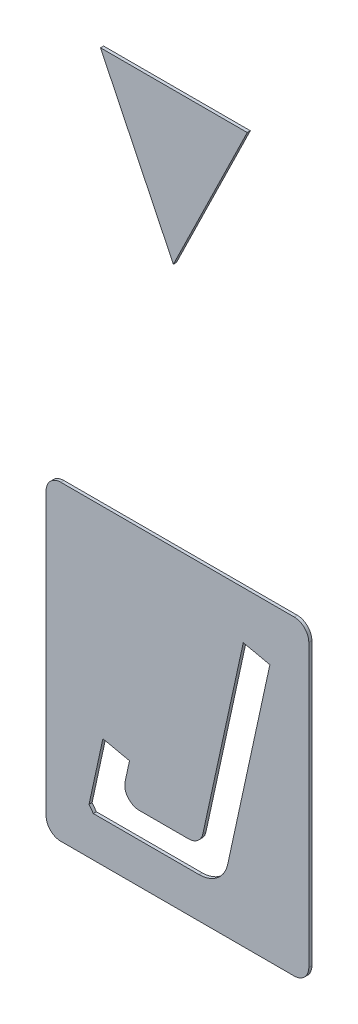
ISO-10303-21;
HEADER;
FILE_DESCRIPTION(('STEP AP214'),'2;1');
FILE_NAME('part.step','',(''),(''),'','','');
FILE_SCHEMA(('AUTOMOTIVE_DESIGN { 1 0 10303 214 1 1 1 1 }'));
ENDSEC;
DATA;
#1=APPLICATION_CONTEXT('core data for automotive mechanical design processes');
#2=APPLICATION_PROTOCOL_DEFINITION('international standard','automotive_design',2000,#1);
#3=PRODUCT_CONTEXT('',#1,'mechanical');
#4=PRODUCT('Part','Part','',(#3));
#5=PRODUCT_RELATED_PRODUCT_CATEGORY('part','',(#4));
#6=PRODUCT_DEFINITION_FORMATION('','',#4);
#7=PRODUCT_DEFINITION_CONTEXT('part definition',#1,'design');
#8=PRODUCT_DEFINITION('design','',#6,#7);
#9=PRODUCT_DEFINITION_SHAPE('','',#8);
#10=(LENGTH_UNIT() NAMED_UNIT(*) SI_UNIT(.MILLI.,.METRE.));
#11=(NAMED_UNIT(*) PLANE_ANGLE_UNIT() SI_UNIT($,.RADIAN.));
#12=(NAMED_UNIT(*) SI_UNIT($,.STERADIAN.) SOLID_ANGLE_UNIT());
#13=UNCERTAINTY_MEASURE_WITH_UNIT(LENGTH_MEASURE(1.E-05),#10,'distance_accuracy_value','');
#14=(GEOMETRIC_REPRESENTATION_CONTEXT(3) GLOBAL_UNCERTAINTY_ASSIGNED_CONTEXT((#13)) GLOBAL_UNIT_ASSIGNED_CONTEXT((#10,
#11,#12)) REPRESENTATION_CONTEXT('',''));
#15=CARTESIAN_POINT('',(0.,0.,0.));
#16=DIRECTION('',(0.,0.,1.));
#17=DIRECTION('',(1.,0.,0.));
#18=AXIS2_PLACEMENT_3D('',#15,#16,#17);
#19=CARTESIAN_POINT('',(3.013889286367,-4.558794197389,0.01));
#20=DIRECTION('',(0.,0.,1.));
#21=DIRECTION('',(1.,0.,0.));
#22=AXIS2_PLACEMENT_3D('',#19,#20,#21);
#23=PLANE('',#22);
#24=DIRECTION('',(0.977176362822359,-0.212429649393078,0.));
#25=VECTOR('',#24,1.);
#26=CARTESIAN_POINT('',(2.915138823425,-4.73816514826,0.01));
#27=LINE('',#26,#25);
#28=CARTESIAN_POINT('',(2.771556768626,-4.706951657308,0.01));
#29=VERTEX_POINT('',#28);
#30=CARTESIAN_POINT('',(2.858078652016,-4.725760762862,0.01));
#31=VERTEX_POINT('',#30);
#32=EDGE_CURVE('P0_E363',#29,#31,#27,.T.);
#33=ORIENTED_EDGE('',*,*,#32,.T.);
#34=DIRECTION('',(-0.212429649393078,-0.977176362822359,0.));
#35=VECTOR('',#34,1.);
#36=CARTESIAN_POINT('',(2.871735257351,-4.662940379891,0.01));
#37=LINE('',#36,#35);
#38=CARTESIAN_POINT('',(2.843701571152,-4.791895333189,0.01));
#39=VERTEX_POINT('',#38);
#40=EDGE_CURVE('P0_E144',#31,#39,#37,.T.);
#41=ORIENTED_EDGE('',*,*,#40,.T.);
#42=CARTESIAN_POINT('',(2.890239595431,-4.802012295242,0.01));
#43=DIRECTION('',(0.,0.,1.));
#44=DIRECTION('',(-0.977176362822359,0.212429649393078,0.));
#45=AXIS2_PLACEMENT_3D('',#42,#43,#44);
#46=CIRCLE('',#45,0.047625);
#47=CARTESIAN_POINT('',(2.890239595431,-4.849637295242,0.01));
#48=VERTEX_POINT('',#47);
#49=EDGE_CURVE('P0_E320',#39,#48,#46,.T.);
#50=ORIENTED_EDGE('',*,*,#49,.T.);
#51=DIRECTION('',(1.,0.,0.));
#52=VECTOR('',#51,1.);
#53=CARTESIAN_POINT('',(3.031905497518,-4.849637295242,0.01));
#54=LINE('',#53,#52);
#55=CARTESIAN_POINT('',(3.049921708669,-4.849637295242,0.01));
#56=VERTEX_POINT('',#55);
#57=EDGE_CURVE('P0_E21',#48,#56,#54,.T.);
#58=ORIENTED_EDGE('',*,*,#57,.T.);
#59=CARTESIAN_POINT('',(3.049921708669,-4.802012295242,0.01));
#60=DIRECTION('',(0.,0.,1.));
#61=DIRECTION('',(0.,-1.,0.));
#62=AXIS2_PLACEMENT_3D('',#59,#60,#61);
#63=CIRCLE('',#62,0.047625);
#64=CARTESIAN_POINT('',(3.096459732948,-4.812129257294,0.01));
#65=VERTEX_POINT('',#64);
#66=EDGE_CURVE('P0_E244',#56,#65,#63,.T.);
#67=ORIENTED_EDGE('',*,*,#66,.T.);
#68=DIRECTION('',(0.212429649393078,0.977176362822359,0.));
#69=VECTOR('',#68,1.);
#70=CARTESIAN_POINT('',(3.186501533019,-4.397936987306,0.01));
#71=LINE('',#70,#69);
#72=CARTESIAN_POINT('',(3.22768183257,-4.208507614097,0.01));
#73=VERTEX_POINT('',#72);
#74=EDGE_CURVE('P0_E230',#65,#73,#71,.T.);
#75=ORIENTED_EDGE('',*,*,#74,.T.);
#76=DIRECTION('',(0.977176362822359,-0.212429649393078,0.));
#77=VECTOR('',#76,1.);
#78=CARTESIAN_POINT('',(3.205226800715,-4.203626085311,0.01));
#79=LINE('',#78,#77);
#80=CARTESIAN_POINT('',(3.314203715961,-4.227316719651,0.01));
#81=VERTEX_POINT('',#80);
#82=EDGE_CURVE('P0_E215',#73,#81,#79,.T.);
#83=ORIENTED_EDGE('',*,*,#82,.T.);
#84=DIRECTION('',(-0.212429649393078,-0.977176362822359,0.));
#85=VECTOR('',#84,1.);
#86=CARTESIAN_POINT('',(3.204463883375,-4.73211993695,0.01));
#87=LINE('',#86,#85);
#88=CARTESIAN_POINT('',(3.177084649891,-4.858064407831,0.01));
#89=VERTEX_POINT('',#88);
#90=EDGE_CURVE('P0_E220',#81,#89,#87,.T.);
#91=ORIENTED_EDGE('',*,*,#90,.T.);
#92=CARTESIAN_POINT('',(3.084008601332,-4.837830483727,0.01));
#93=DIRECTION('',(0.,0.,-1.));
#94=DIRECTION('',(0.,1.,0.));
#95=AXIS2_PLACEMENT_3D('',#92,#93,#94);
#96=CIRCLE('',#95,0.09525);
#97=CARTESIAN_POINT('',(3.084008601332,-4.933080483727,0.01));
#98=VERTEX_POINT('',#97);
#99=EDGE_CURVE('P0_E334',#89,#98,#96,.T.);
#100=ORIENTED_EDGE('',*,*,#99,.T.);
#101=DIRECTION('',(-1.,0.,0.));
#102=VECTOR('',#101,1.);
#103=CARTESIAN_POINT('',(2.877213718638,-4.933080483727,0.01));
#104=LINE('',#103,#102);
#105=CARTESIAN_POINT('',(2.74053815091,-4.933080483727,0.01));
#106=VERTEX_POINT('',#105);
#107=EDGE_CURVE('P0_E250',#98,#106,#104,.T.);
#108=ORIENTED_EDGE('',*,*,#107,.T.);
#109=DIRECTION('',(-0.598473967642059,0.801142253320078,0.));
#110=VECTOR('',#109,1.);
#111=CARTESIAN_POINT('',(2.692737771758,-4.869092899415,0.01));
#112=LINE('',#111,#110);
#113=CARTESIAN_POINT('',(2.726487262965,-4.914271378172,0.01));
#114=VERTEX_POINT('',#113);
#115=EDGE_CURVE('P0_E357',#106,#114,#112,.T.);
#116=ORIENTED_EDGE('',*,*,#115,.T.);
#117=DIRECTION('',(0.212429649393078,0.977176362822359,0.));
#118=VECTOR('',#117,1.);
#119=CARTESIAN_POINT('',(2.792401914393,-4.611063989173,0.01));
#120=LINE('',#119,#118);
#121=EDGE_CURVE('P0_E129',#114,#29,#120,.T.);
#122=ORIENTED_EDGE('',*,*,#121,.T.);
#123=EDGE_LOOP('',(#33,#41,#50,#58,#67,#75,#83,#91,#100,#108,#116,#122));
#124=FACE_BOUND('',#123,.T.);
#125=CARTESIAN_POINT('',(2.634724387193,-4.101239326386,0.01));
#126=DIRECTION('',(0.,0.,1.));
#127=DIRECTION('',(0.,-1.,0.));
#128=AXIS2_PLACEMENT_3D('',#125,#126,#127);
#129=CIRCLE('',#128,0.047625);
#130=CARTESIAN_POINT('',(2.634724387193,-4.053614326386,0.01));
#131=VERTEX_POINT('',#130);
#132=CARTESIAN_POINT('',(2.587099387193,-4.101239326386,0.01));
#133=VERTEX_POINT('',#132);
#134=EDGE_CURVE('P0_E11',#131,#133,#129,.T.);
#135=ORIENTED_EDGE('',*,*,#134,.T.);
#136=DIRECTION('',(0.,-1.,0.));
#137=VECTOR('',#136,1.);
#138=CARTESIAN_POINT('',(2.587099387193,-5.016349068392,0.01));
#139=LINE('',#138,#137);
#140=CARTESIAN_POINT('',(2.587099387193,-5.016349068392,0.01));
#141=VERTEX_POINT('',#140);
#142=EDGE_CURVE('P0_E343',#133,#141,#139,.T.);
#143=ORIENTED_EDGE('',*,*,#142,.T.);
#144=CARTESIAN_POINT('',(2.634724387193,-5.016349068392,0.01));
#145=DIRECTION('',(0.,0.,1.));
#146=DIRECTION('',(1.,0.,0.));
#147=AXIS2_PLACEMENT_3D('',#144,#145,#146);
#148=CIRCLE('',#147,0.047625);
#149=CARTESIAN_POINT('',(2.634724387193,-5.063974068392,0.01));
#150=VERTEX_POINT('',#149);
#151=EDGE_CURVE('P0_E265',#141,#150,#148,.T.);
#152=ORIENTED_EDGE('',*,*,#151,.T.);
#153=DIRECTION('',(1.,0.,0.));
#154=VECTOR('',#153,1.);
#155=CARTESIAN_POINT('',(3.393054185541,-5.063974068392,0.01));
#156=LINE('',#155,#154);
#157=CARTESIAN_POINT('',(3.393054185541,-5.063974068392,0.01));
#158=VERTEX_POINT('',#157);
#159=EDGE_CURVE('P0_E266',#150,#158,#156,.T.);
#160=ORIENTED_EDGE('',*,*,#159,.T.);
#161=CARTESIAN_POINT('',(3.393054185541,-5.016349068392,0.01));
#162=DIRECTION('',(0.,0.,1.));
#163=DIRECTION('',(0.,1.,0.));
#164=AXIS2_PLACEMENT_3D('',#161,#162,#163);
#165=CIRCLE('',#164,0.047625);
#166=CARTESIAN_POINT('',(3.440679185541,-5.016349068392,0.01));
#167=VERTEX_POINT('',#166);
#168=EDGE_CURVE('P0_E322',#158,#167,#165,.T.);
#169=ORIENTED_EDGE('',*,*,#168,.T.);
#170=DIRECTION('',(0.,1.,0.));
#171=VECTOR('',#170,1.);
#172=CARTESIAN_POINT('',(3.440679185541,-4.101239326386,0.01));
#173=LINE('',#172,#171);
#174=CARTESIAN_POINT('',(3.440679185541,-4.101239326386,0.01));
#175=VERTEX_POINT('',#174);
#176=EDGE_CURVE('P0_E430',#167,#175,#173,.T.);
#177=ORIENTED_EDGE('',*,*,#176,.T.);
#178=CARTESIAN_POINT('',(3.393054185541,-4.101239326386,0.01));
#179=DIRECTION('',(0.,0.,1.));
#180=DIRECTION('',(-1.,0.,0.));
#181=AXIS2_PLACEMENT_3D('',#178,#179,#180);
#182=CIRCLE('',#181,0.047625);
#183=CARTESIAN_POINT('',(3.393054185541,-4.053614326386,0.01));
#184=VERTEX_POINT('',#183);
#185=EDGE_CURVE('P0_E255',#175,#184,#182,.T.);
#186=ORIENTED_EDGE('',*,*,#185,.T.);
#187=DIRECTION('',(-1.,0.,0.));
#188=VECTOR('',#187,1.);
#189=CARTESIAN_POINT('',(2.634724387193,-4.053614326386,0.01));
#190=LINE('',#189,#188);
#191=EDGE_CURVE('P0_E295',#184,#131,#190,.T.);
#192=ORIENTED_EDGE('',*,*,#191,.T.);
#193=EDGE_LOOP('',(#135,#143,#152,#160,#169,#177,#186,#192));
#194=FACE_BOUND('',#193,.T.);
#195=ADVANCED_FACE('P0_F17',(#124,#194),#23,.T.);
#196=CARTESIAN_POINT('',(3.013889286367,-4.558794197389,0.));
#197=DIRECTION('',(0.,0.,1.));
#198=DIRECTION('',(1.,0.,0.));
#199=AXIS2_PLACEMENT_3D('',#196,#197,#198);
#200=PLANE('',#199);
#201=DIRECTION('',(-0.977176362822359,0.212429649393078,0.));
#202=VECTOR('',#201,1.);
#203=CARTESIAN_POINT('',(2.915138823425,-4.73816514826,0.));
#204=LINE('',#203,#202);
#205=CARTESIAN_POINT('',(2.858078652016,-4.725760762862,0.));
#206=VERTEX_POINT('',#205);
#207=CARTESIAN_POINT('',(2.771556768626,-4.706951657308,0.));
#208=VERTEX_POINT('',#207);
#209=EDGE_CURVE('P0_E282',#206,#208,#204,.T.);
#210=ORIENTED_EDGE('',*,*,#209,.T.);
#211=DIRECTION('',(-0.212429649393078,-0.977176362822359,0.));
#212=VECTOR('',#211,1.);
#213=CARTESIAN_POINT('',(2.792401914393,-4.611063989173,0.));
#214=LINE('',#213,#212);
#215=CARTESIAN_POINT('',(2.726487262965,-4.914271378172,0.));
#216=VERTEX_POINT('',#215);
#217=EDGE_CURVE('P0_E304',#208,#216,#214,.T.);
#218=ORIENTED_EDGE('',*,*,#217,.T.);
#219=DIRECTION('',(0.598473967642059,-0.801142253320078,0.));
#220=VECTOR('',#219,1.);
#221=CARTESIAN_POINT('',(2.692737771758,-4.869092899415,0.));
#222=LINE('',#221,#220);
#223=CARTESIAN_POINT('',(2.74053815091,-4.933080483727,0.));
#224=VERTEX_POINT('',#223);
#225=EDGE_CURVE('P0_E246',#216,#224,#222,.T.);
#226=ORIENTED_EDGE('',*,*,#225,.T.);
#227=DIRECTION('',(1.,0.,0.));
#228=VECTOR('',#227,1.);
#229=CARTESIAN_POINT('',(2.877213718638,-4.933080483727,0.));
#230=LINE('',#229,#228);
#231=CARTESIAN_POINT('',(3.084008601332,-4.933080483727,0.));
#232=VERTEX_POINT('',#231);
#233=EDGE_CURVE('P0_E300',#224,#232,#230,.T.);
#234=ORIENTED_EDGE('',*,*,#233,.T.);
#235=CARTESIAN_POINT('',(3.084008601332,-4.837830483727,0.));
#236=DIRECTION('',(0.,0.,1.));
#237=DIRECTION('',(0.,1.,0.));
#238=AXIS2_PLACEMENT_3D('',#235,#236,#237);
#239=CIRCLE('',#238,0.09525);
#240=CARTESIAN_POINT('',(3.177084649891,-4.858064407831,0.));
#241=VERTEX_POINT('',#240);
#242=EDGE_CURVE('P0_E209',#232,#241,#239,.T.);
#243=ORIENTED_EDGE('',*,*,#242,.T.);
#244=DIRECTION('',(0.212429649393078,0.977176362822359,0.));
#245=VECTOR('',#244,1.);
#246=CARTESIAN_POINT('',(3.204463883375,-4.73211993695,0.));
#247=LINE('',#246,#245);
#248=CARTESIAN_POINT('',(3.314203715961,-4.227316719651,0.));
#249=VERTEX_POINT('',#248);
#250=EDGE_CURVE('P0_E200',#241,#249,#247,.T.);
#251=ORIENTED_EDGE('',*,*,#250,.T.);
#252=DIRECTION('',(-0.977176362822359,0.212429649393078,0.));
#253=VECTOR('',#252,1.);
#254=CARTESIAN_POINT('',(3.205226800715,-4.203626085311,0.));
#255=LINE('',#254,#253);
#256=CARTESIAN_POINT('',(3.22768183257,-4.208507614097,0.));
#257=VERTEX_POINT('',#256);
#258=EDGE_CURVE('P0_E206',#249,#257,#255,.T.);
#259=ORIENTED_EDGE('',*,*,#258,.T.);
#260=DIRECTION('',(-0.212429649393078,-0.977176362822359,0.));
#261=VECTOR('',#260,1.);
#262=CARTESIAN_POINT('',(3.186501533019,-4.397936987306,0.));
#263=LINE('',#262,#261);
#264=CARTESIAN_POINT('',(3.096459732948,-4.812129257294,0.));
#265=VERTEX_POINT('',#264);
#266=EDGE_CURVE('P0_E273',#257,#265,#263,.T.);
#267=ORIENTED_EDGE('',*,*,#266,.T.);
#268=CARTESIAN_POINT('',(3.049921708669,-4.802012295242,0.));
#269=DIRECTION('',(0.,0.,-1.));
#270=DIRECTION('',(0.,-1.,0.));
#271=AXIS2_PLACEMENT_3D('',#268,#269,#270);
#272=CIRCLE('',#271,0.047625);
#273=CARTESIAN_POINT('',(3.049921708669,-4.849637295242,0.));
#274=VERTEX_POINT('',#273);
#275=EDGE_CURVE('P0_E245',#265,#274,#272,.T.);
#276=ORIENTED_EDGE('',*,*,#275,.T.);
#277=DIRECTION('',(-1.,0.,0.));
#278=VECTOR('',#277,1.);
#279=CARTESIAN_POINT('',(3.031905497518,-4.849637295242,0.));
#280=LINE('',#279,#278);
#281=CARTESIAN_POINT('',(2.890239595431,-4.849637295242,0.));
#282=VERTEX_POINT('',#281);
#283=EDGE_CURVE('P0_E372',#274,#282,#280,.T.);
#284=ORIENTED_EDGE('',*,*,#283,.T.);
#285=CARTESIAN_POINT('',(2.890239595431,-4.802012295242,0.));
#286=DIRECTION('',(0.,0.,-1.));
#287=DIRECTION('',(-0.977176362822359,0.212429649393078,0.));
#288=AXIS2_PLACEMENT_3D('',#285,#286,#287);
#289=CIRCLE('',#288,0.047625);
#290=CARTESIAN_POINT('',(2.843701571152,-4.791895333189,0.));
#291=VERTEX_POINT('',#290);
#292=EDGE_CURVE('P0_E321',#282,#291,#289,.T.);
#293=ORIENTED_EDGE('',*,*,#292,.T.);
#294=DIRECTION('',(0.212429649393078,0.977176362822359,0.));
#295=VECTOR('',#294,1.);
#296=CARTESIAN_POINT('',(2.871735257351,-4.662940379891,0.));
#297=LINE('',#296,#295);
#298=EDGE_CURVE('P0_E286',#291,#206,#297,.T.);
#299=ORIENTED_EDGE('',*,*,#298,.T.);
#300=EDGE_LOOP('',(#210,#218,#226,#234,#243,#251,#259,#267,#276,#284,#293,#299));
#301=FACE_BOUND('',#300,.T.);
#302=CARTESIAN_POINT('',(2.634724387193,-4.101239326386,0.));
#303=DIRECTION('',(0.,0.,-1.));
#304=DIRECTION('',(0.,-1.,0.));
#305=AXIS2_PLACEMENT_3D('',#302,#303,#304);
#306=CIRCLE('',#305,0.047625);
#307=CARTESIAN_POINT('',(2.587099387193,-4.101239326386,0.));
#308=VERTEX_POINT('',#307);
#309=CARTESIAN_POINT('',(2.634724387193,-4.053614326386,0.));
#310=VERTEX_POINT('',#309);
#311=EDGE_CURVE('P0_E28',#308,#310,#306,.T.);
#312=ORIENTED_EDGE('',*,*,#311,.T.);
#313=DIRECTION('',(1.,0.,0.));
#314=VECTOR('',#313,1.);
#315=CARTESIAN_POINT('',(2.634724387193,-4.053614326386,0.));
#316=LINE('',#315,#314);
#317=CARTESIAN_POINT('',(3.393054185541,-4.053614326386,0.));
#318=VERTEX_POINT('',#317);
#319=EDGE_CURVE('P0_E303',#310,#318,#316,.T.);
#320=ORIENTED_EDGE('',*,*,#319,.T.);
#321=CARTESIAN_POINT('',(3.393054185541,-4.101239326386,0.));
#322=DIRECTION('',(0.,0.,-1.));
#323=DIRECTION('',(-1.,0.,0.));
#324=AXIS2_PLACEMENT_3D('',#321,#322,#323);
#325=CIRCLE('',#324,0.047625);
#326=CARTESIAN_POINT('',(3.440679185541,-4.101239326386,0.));
#327=VERTEX_POINT('',#326);
#328=EDGE_CURVE('P0_E251',#318,#327,#325,.T.);
#329=ORIENTED_EDGE('',*,*,#328,.T.);
#330=DIRECTION('',(0.,-1.,0.));
#331=VECTOR('',#330,1.);
#332=CARTESIAN_POINT('',(3.440679185541,-4.101239326386,0.));
#333=LINE('',#332,#331);
#334=CARTESIAN_POINT('',(3.440679185541,-5.016349068392,0.));
#335=VERTEX_POINT('',#334);
#336=EDGE_CURVE('P0_E315',#327,#335,#333,.T.);
#337=ORIENTED_EDGE('',*,*,#336,.T.);
#338=CARTESIAN_POINT('',(3.393054185541,-5.016349068392,0.));
#339=DIRECTION('',(0.,0.,-1.));
#340=DIRECTION('',(0.,1.,0.));
#341=AXIS2_PLACEMENT_3D('',#338,#339,#340);
#342=CIRCLE('',#341,0.047625);
#343=CARTESIAN_POINT('',(3.393054185541,-5.063974068392,0.));
#344=VERTEX_POINT('',#343);
#345=EDGE_CURVE('P0_E326',#335,#344,#342,.T.);
#346=ORIENTED_EDGE('',*,*,#345,.T.);
#347=DIRECTION('',(-1.,0.,0.));
#348=VECTOR('',#347,1.);
#349=CARTESIAN_POINT('',(3.393054185541,-5.063974068392,0.));
#350=LINE('',#349,#348);
#351=CARTESIAN_POINT('',(2.634724387193,-5.063974068392,0.));
#352=VERTEX_POINT('',#351);
#353=EDGE_CURVE('P0_E270',#344,#352,#350,.T.);
#354=ORIENTED_EDGE('',*,*,#353,.T.);
#355=CARTESIAN_POINT('',(2.634724387193,-5.016349068392,0.));
#356=DIRECTION('',(0.,0.,-1.));
#357=DIRECTION('',(1.,0.,0.));
#358=AXIS2_PLACEMENT_3D('',#355,#356,#357);
#359=CIRCLE('',#358,0.047625);
#360=CARTESIAN_POINT('',(2.587099387193,-5.016349068392,0.));
#361=VERTEX_POINT('',#360);
#362=EDGE_CURVE('P0_E278',#352,#361,#359,.T.);
#363=ORIENTED_EDGE('',*,*,#362,.T.);
#364=DIRECTION('',(0.,1.,0.));
#365=VECTOR('',#364,1.);
#366=CARTESIAN_POINT('',(2.587099387193,-5.016349068392,0.));
#367=LINE('',#366,#365);
#368=EDGE_CURVE('P0_E264',#361,#308,#367,.T.);
#369=ORIENTED_EDGE('',*,*,#368,.T.);
#370=EDGE_LOOP('',(#312,#320,#329,#337,#346,#354,#363,#369));
#371=FACE_BOUND('',#370,.T.);
#372=ADVANCED_FACE('P0_F203',(#301,#371),#200,.F.);
#373=CARTESIAN_POINT('',(2.634724387193,-4.101239326386,0.));
#374=DIRECTION('',(0.,0.,1.));
#375=DIRECTION('',(0.,-1.,0.));
#376=AXIS2_PLACEMENT_3D('',#373,#374,#375);
#377=CYLINDRICAL_SURFACE('',#376,0.047625);
#378=ORIENTED_EDGE('',*,*,#311,.F.);
#379=DIRECTION('',(0.,0.,1.));
#380=VECTOR('',#379,1.);
#381=CARTESIAN_POINT('',(2.587099387193,-4.101239326386,0.));
#382=LINE('',#381,#380);
#383=EDGE_CURVE('P0_E281',#308,#133,#382,.T.);
#384=ORIENTED_EDGE('',*,*,#383,.T.);
#385=ORIENTED_EDGE('',*,*,#134,.F.);
#386=DIRECTION('',(0.,0.,1.));
#387=VECTOR('',#386,1.);
#388=CARTESIAN_POINT('',(2.634724387193,-4.053614326386,0.));
#389=LINE('',#388,#387);
#390=EDGE_CURVE('P0_E305',#310,#131,#389,.T.);
#391=ORIENTED_EDGE('',*,*,#390,.F.);
#392=EDGE_LOOP('',(#378,#384,#385,#391));
#393=FACE_BOUND('',#392,.T.);
#394=ADVANCED_FACE('P0_F477',(#393),#377,.T.);
#395=CARTESIAN_POINT('',(2.587099387193,-4.101239326386,0.));
#396=DIRECTION('',(-1.,0.,0.));
#397=DIRECTION('',(0.,0.,1.));
#398=AXIS2_PLACEMENT_3D('',#395,#396,#397);
#399=PLANE('',#398);
#400=ORIENTED_EDGE('',*,*,#368,.F.);
#401=DIRECTION('',(0.,0.,1.));
#402=VECTOR('',#401,1.);
#403=CARTESIAN_POINT('',(2.587099387193,-5.016349068392,0.));
#404=LINE('',#403,#402);
#405=EDGE_CURVE('P0_E260',#361,#141,#404,.T.);
#406=ORIENTED_EDGE('',*,*,#405,.T.);
#407=ORIENTED_EDGE('',*,*,#142,.F.);
#408=ORIENTED_EDGE('',*,*,#383,.F.);
#409=EDGE_LOOP('',(#400,#406,#407,#408));
#410=FACE_BOUND('',#409,.T.);
#411=ADVANCED_FACE('P0_F498',(#410),#399,.T.);
#412=CARTESIAN_POINT('',(2.634724387193,-5.016349068392,0.));
#413=DIRECTION('',(0.,0.,1.));
#414=DIRECTION('',(1.,0.,0.));
#415=AXIS2_PLACEMENT_3D('',#412,#413,#414);
#416=CYLINDRICAL_SURFACE('',#415,0.047625);
#417=ORIENTED_EDGE('',*,*,#362,.F.);
#418=DIRECTION('',(0.,0.,1.));
#419=VECTOR('',#418,1.);
#420=CARTESIAN_POINT('',(2.634724387193,-5.063974068392,0.));
#421=LINE('',#420,#419);
#422=EDGE_CURVE('P0_E269',#352,#150,#421,.T.);
#423=ORIENTED_EDGE('',*,*,#422,.T.);
#424=ORIENTED_EDGE('',*,*,#151,.F.);
#425=ORIENTED_EDGE('',*,*,#405,.F.);
#426=EDGE_LOOP('',(#417,#423,#424,#425));
#427=FACE_BOUND('',#426,.T.);
#428=ADVANCED_FACE('P0_F494',(#427),#416,.T.);
#429=CARTESIAN_POINT('',(2.634724387193,-5.063974068392,0.));
#430=DIRECTION('',(0.,-1.,0.));
#431=DIRECTION('',(0.,0.,-1.));
#432=AXIS2_PLACEMENT_3D('',#429,#430,#431);
#433=PLANE('',#432);
#434=ORIENTED_EDGE('',*,*,#353,.F.);
#435=DIRECTION('',(0.,0.,1.));
#436=VECTOR('',#435,1.);
#437=CARTESIAN_POINT('',(3.393054185541,-5.063974068392,0.));
#438=LINE('',#437,#436);
#439=EDGE_CURVE('P0_E325',#344,#158,#438,.T.);
#440=ORIENTED_EDGE('',*,*,#439,.T.);
#441=ORIENTED_EDGE('',*,*,#159,.F.);
#442=ORIENTED_EDGE('',*,*,#422,.F.);
#443=EDGE_LOOP('',(#434,#440,#441,#442));
#444=FACE_BOUND('',#443,.T.);
#445=ADVANCED_FACE('P0_F490',(#444),#433,.T.);
#446=CARTESIAN_POINT('',(3.393054185541,-5.016349068392,0.));
#447=DIRECTION('',(0.,0.,1.));
#448=DIRECTION('',(0.,1.,0.));
#449=AXIS2_PLACEMENT_3D('',#446,#447,#448);
#450=CYLINDRICAL_SURFACE('',#449,0.047625);
#451=ORIENTED_EDGE('',*,*,#345,.F.);
#452=DIRECTION('',(0.,0.,1.));
#453=VECTOR('',#452,1.);
#454=CARTESIAN_POINT('',(3.440679185541,-5.016349068392,0.));
#455=LINE('',#454,#453);
#456=EDGE_CURVE('P0_E424',#335,#167,#455,.T.);
#457=ORIENTED_EDGE('',*,*,#456,.T.);
#458=ORIENTED_EDGE('',*,*,#168,.F.);
#459=ORIENTED_EDGE('',*,*,#439,.F.);
#460=EDGE_LOOP('',(#451,#457,#458,#459));
#461=FACE_BOUND('',#460,.T.);
#462=ADVANCED_FACE('P0_F493',(#461),#450,.T.);
#463=CARTESIAN_POINT('',(3.440679185541,-5.016349068392,0.));
#464=DIRECTION('',(1.,0.,0.));
#465=DIRECTION('',(0.,1.,0.));
#466=AXIS2_PLACEMENT_3D('',#463,#464,#465);
#467=PLANE('',#466);
#468=ORIENTED_EDGE('',*,*,#336,.F.);
#469=DIRECTION('',(0.,0.,1.));
#470=VECTOR('',#469,1.);
#471=CARTESIAN_POINT('',(3.440679185541,-4.101239326386,0.));
#472=LINE('',#471,#470);
#473=EDGE_CURVE('P0_E311',#327,#175,#472,.T.);
#474=ORIENTED_EDGE('',*,*,#473,.T.);
#475=ORIENTED_EDGE('',*,*,#176,.F.);
#476=ORIENTED_EDGE('',*,*,#456,.F.);
#477=EDGE_LOOP('',(#468,#474,#475,#476));
#478=FACE_BOUND('',#477,.T.);
#479=ADVANCED_FACE('P0_F486',(#478),#467,.T.);
#480=CARTESIAN_POINT('',(3.393054185541,-4.101239326386,0.));
#481=DIRECTION('',(0.,0.,1.));
#482=DIRECTION('',(-1.,0.,0.));
#483=AXIS2_PLACEMENT_3D('',#480,#481,#482);
#484=CYLINDRICAL_SURFACE('',#483,0.047625);
#485=ORIENTED_EDGE('',*,*,#328,.F.);
#486=DIRECTION('',(0.,0.,1.));
#487=VECTOR('',#486,1.);
#488=CARTESIAN_POINT('',(3.393054185541,-4.053614326386,0.));
#489=LINE('',#488,#487);
#490=EDGE_CURVE('P0_E256',#318,#184,#489,.T.);
#491=ORIENTED_EDGE('',*,*,#490,.T.);
#492=ORIENTED_EDGE('',*,*,#185,.F.);
#493=ORIENTED_EDGE('',*,*,#473,.F.);
#494=EDGE_LOOP('',(#485,#491,#492,#493));
#495=FACE_BOUND('',#494,.T.);
#496=ADVANCED_FACE('P0_F467',(#495),#484,.T.);
#497=CARTESIAN_POINT('',(3.393054185541,-4.053614326386,0.));
#498=DIRECTION('',(0.,1.,0.));
#499=DIRECTION('',(1.,0.,0.));
#500=AXIS2_PLACEMENT_3D('',#497,#498,#499);
#501=PLANE('',#500);
#502=ORIENTED_EDGE('',*,*,#319,.F.);
#503=ORIENTED_EDGE('',*,*,#390,.T.);
#504=ORIENTED_EDGE('',*,*,#191,.F.);
#505=ORIENTED_EDGE('',*,*,#490,.F.);
#506=EDGE_LOOP('',(#502,#503,#504,#505));
#507=FACE_BOUND('',#506,.T.);
#508=ADVANCED_FACE('P0_F459',(#507),#501,.T.);
#509=CARTESIAN_POINT('',(2.771556768626,-4.706951657308,0.));
#510=DIRECTION('',(-0.977176362822359,0.212429649393078,0.));
#511=DIRECTION('',(0.,0.,1.));
#512=AXIS2_PLACEMENT_3D('',#509,#510,#511);
#513=PLANE('',#512);
#514=ORIENTED_EDGE('',*,*,#217,.F.);
#515=DIRECTION('',(0.,0.,1.));
#516=VECTOR('',#515,1.);
#517=CARTESIAN_POINT('',(2.771556768626,-4.706951657308,0.));
#518=LINE('',#517,#516);
#519=EDGE_CURVE('P0_E291',#208,#29,#518,.T.);
#520=ORIENTED_EDGE('',*,*,#519,.T.);
#521=ORIENTED_EDGE('',*,*,#121,.F.);
#522=DIRECTION('',(0.,0.,1.));
#523=VECTOR('',#522,1.);
#524=CARTESIAN_POINT('',(2.726487262965,-4.914271378172,0.));
#525=LINE('',#524,#523);
#526=EDGE_CURVE('P0_E249',#216,#114,#525,.T.);
#527=ORIENTED_EDGE('',*,*,#526,.F.);
#528=EDGE_LOOP('',(#514,#520,#521,#527));
#529=FACE_BOUND('',#528,.T.);
#530=ADVANCED_FACE('P0_F457',(#529),#513,.F.);
#531=CARTESIAN_POINT('',(2.726487262965,-4.914271378172,0.));
#532=DIRECTION('',(-0.801142253320078,-0.598473967642059,0.));
#533=DIRECTION('',(-0.598473967642059,0.801142253320078,0.));
#534=AXIS2_PLACEMENT_3D('',#531,#532,#533);
#535=PLANE('',#534);
#536=ORIENTED_EDGE('',*,*,#225,.F.);
#537=ORIENTED_EDGE('',*,*,#526,.T.);
#538=ORIENTED_EDGE('',*,*,#115,.F.);
#539=DIRECTION('',(0.,0.,1.));
#540=VECTOR('',#539,1.);
#541=CARTESIAN_POINT('',(2.74053815091,-4.933080483727,0.));
#542=LINE('',#541,#540);
#543=EDGE_CURVE('P0_E296',#224,#106,#542,.T.);
#544=ORIENTED_EDGE('',*,*,#543,.F.);
#545=EDGE_LOOP('',(#536,#537,#538,#544));
#546=FACE_BOUND('',#545,.T.);
#547=ADVANCED_FACE('P0_F416',(#546),#535,.F.);
#548=CARTESIAN_POINT('',(2.74053815091,-4.933080483727,0.));
#549=DIRECTION('',(0.,-1.,0.));
#550=DIRECTION('',(0.,0.,-1.));
#551=AXIS2_PLACEMENT_3D('',#548,#549,#550);
#552=PLANE('',#551);
#553=ORIENTED_EDGE('',*,*,#233,.F.);
#554=ORIENTED_EDGE('',*,*,#543,.T.);
#555=ORIENTED_EDGE('',*,*,#107,.F.);
#556=DIRECTION('',(0.,0.,1.));
#557=VECTOR('',#556,1.);
#558=CARTESIAN_POINT('',(3.084008601332,-4.933080483727,0.));
#559=LINE('',#558,#557);
#560=EDGE_CURVE('P0_E259',#232,#98,#559,.T.);
#561=ORIENTED_EDGE('',*,*,#560,.F.);
#562=EDGE_LOOP('',(#553,#554,#555,#561));
#563=FACE_BOUND('',#562,.T.);
#564=ADVANCED_FACE('P0_F408',(#563),#552,.F.);
#565=CARTESIAN_POINT('',(3.084008601332,-4.837830483727,0.));
#566=DIRECTION('',(0.,0.,1.));
#567=DIRECTION('',(0.,1.,0.));
#568=AXIS2_PLACEMENT_3D('',#565,#566,#567);
#569=CYLINDRICAL_SURFACE('',#568,0.09525);
#570=ORIENTED_EDGE('',*,*,#242,.F.);
#571=ORIENTED_EDGE('',*,*,#560,.T.);
#572=ORIENTED_EDGE('',*,*,#99,.F.);
#573=DIRECTION('',(0.,0.,1.));
#574=VECTOR('',#573,1.);
#575=CARTESIAN_POINT('',(3.177084649891,-4.858064407831,0.));
#576=LINE('',#575,#574);
#577=EDGE_CURVE('P0_E214',#241,#89,#576,.T.);
#578=ORIENTED_EDGE('',*,*,#577,.F.);
#579=EDGE_LOOP('',(#570,#571,#572,#578));
#580=FACE_BOUND('',#579,.T.);
#581=ADVANCED_FACE('P0_F404',(#580),#569,.F.);
#582=CARTESIAN_POINT('',(3.177084649891,-4.858064407831,0.));
#583=DIRECTION('',(0.977176362822359,-0.212429649393078,0.));
#584=DIRECTION('',(0.,0.,-1.));
#585=AXIS2_PLACEMENT_3D('',#582,#583,#584);
#586=PLANE('',#585);
#587=ORIENTED_EDGE('',*,*,#250,.F.);
#588=ORIENTED_EDGE('',*,*,#577,.T.);
#589=ORIENTED_EDGE('',*,*,#90,.F.);
#590=DIRECTION('',(0.,0.,1.));
#591=VECTOR('',#590,1.);
#592=CARTESIAN_POINT('',(3.314203715961,-4.227316719651,0.));
#593=LINE('',#592,#591);
#594=EDGE_CURVE('P0_E217',#249,#81,#593,.T.);
#595=ORIENTED_EDGE('',*,*,#594,.F.);
#596=EDGE_LOOP('',(#587,#588,#589,#595));
#597=FACE_BOUND('',#596,.T.);
#598=ADVANCED_FACE('P0_F218',(#597),#586,.F.);
#599=CARTESIAN_POINT('',(3.314203715961,-4.227316719651,0.));
#600=DIRECTION('',(0.212429649393078,0.977176362822359,0.));
#601=DIRECTION('',(0.,0.,-1.));
#602=AXIS2_PLACEMENT_3D('',#599,#600,#601);
#603=PLANE('',#602);
#604=ORIENTED_EDGE('',*,*,#258,.F.);
#605=ORIENTED_EDGE('',*,*,#594,.T.);
#606=ORIENTED_EDGE('',*,*,#82,.F.);
#607=DIRECTION('',(0.,0.,1.));
#608=VECTOR('',#607,1.);
#609=CARTESIAN_POINT('',(3.22768183257,-4.208507614097,0.));
#610=LINE('',#609,#608);
#611=EDGE_CURVE('P0_E227',#257,#73,#610,.T.);
#612=ORIENTED_EDGE('',*,*,#611,.F.);
#613=EDGE_LOOP('',(#604,#605,#606,#612));
#614=FACE_BOUND('',#613,.T.);
#615=ADVANCED_FACE('P0_F225',(#614),#603,.F.);
#616=CARTESIAN_POINT('',(3.22768183257,-4.208507614097,0.));
#617=DIRECTION('',(-0.977176362822359,0.212429649393078,0.));
#618=DIRECTION('',(0.,0.,1.));
#619=AXIS2_PLACEMENT_3D('',#616,#617,#618);
#620=PLANE('',#619);
#621=ORIENTED_EDGE('',*,*,#266,.F.);
#622=ORIENTED_EDGE('',*,*,#611,.T.);
#623=ORIENTED_EDGE('',*,*,#74,.F.);
#624=DIRECTION('',(0.,0.,1.));
#625=VECTOR('',#624,1.);
#626=CARTESIAN_POINT('',(3.096459732948,-4.812129257294,0.));
#627=LINE('',#626,#625);
#628=EDGE_CURVE('P0_E240',#265,#65,#627,.T.);
#629=ORIENTED_EDGE('',*,*,#628,.F.);
#630=EDGE_LOOP('',(#621,#622,#623,#629));
#631=FACE_BOUND('',#630,.T.);
#632=ADVANCED_FACE('P0_F390',(#631),#620,.F.);
#633=CARTESIAN_POINT('',(3.049921708669,-4.802012295242,0.));
#634=DIRECTION('',(0.,0.,1.));
#635=DIRECTION('',(0.,-1.,0.));
#636=AXIS2_PLACEMENT_3D('',#633,#634,#635);
#637=CYLINDRICAL_SURFACE('',#636,0.047625);
#638=ORIENTED_EDGE('',*,*,#275,.F.);
#639=ORIENTED_EDGE('',*,*,#628,.T.);
#640=ORIENTED_EDGE('',*,*,#66,.F.);
#641=DIRECTION('',(0.,0.,1.));
#642=VECTOR('',#641,1.);
#643=CARTESIAN_POINT('',(3.049921708669,-4.849637295242,0.));
#644=LINE('',#643,#642);
#645=EDGE_CURVE('P0_E368',#274,#56,#644,.T.);
#646=ORIENTED_EDGE('',*,*,#645,.F.);
#647=EDGE_LOOP('',(#638,#639,#640,#646));
#648=FACE_BOUND('',#647,.T.);
#649=ADVANCED_FACE('P0_F388',(#648),#637,.T.);
#650=CARTESIAN_POINT('',(3.049921708669,-4.849637295242,0.));
#651=DIRECTION('',(0.,1.,0.));
#652=DIRECTION('',(1.,0.,0.));
#653=AXIS2_PLACEMENT_3D('',#650,#651,#652);
#654=PLANE('',#653);
#655=ORIENTED_EDGE('',*,*,#283,.F.);
#656=ORIENTED_EDGE('',*,*,#645,.T.);
#657=ORIENTED_EDGE('',*,*,#57,.F.);
#658=DIRECTION('',(0.,0.,1.));
#659=VECTOR('',#658,1.);
#660=CARTESIAN_POINT('',(2.890239595431,-4.849637295242,0.));
#661=LINE('',#660,#659);
#662=EDGE_CURVE('P0_E316',#282,#48,#661,.T.);
#663=ORIENTED_EDGE('',*,*,#662,.F.);
#664=EDGE_LOOP('',(#655,#656,#657,#663));
#665=FACE_BOUND('',#664,.T.);
#666=ADVANCED_FACE('P0_F19',(#665),#654,.F.);
#667=CARTESIAN_POINT('',(2.890239595431,-4.802012295242,0.));
#668=DIRECTION('',(0.,0.,1.));
#669=DIRECTION('',(-0.977176362822359,0.212429649393078,0.));
#670=AXIS2_PLACEMENT_3D('',#667,#668,#669);
#671=CYLINDRICAL_SURFACE('',#670,0.047625);
#672=ORIENTED_EDGE('',*,*,#292,.F.);
#673=ORIENTED_EDGE('',*,*,#662,.T.);
#674=ORIENTED_EDGE('',*,*,#49,.F.);
#675=DIRECTION('',(0.,0.,1.));
#676=VECTOR('',#675,1.);
#677=CARTESIAN_POINT('',(2.843701571152,-4.791895333189,0.));
#678=LINE('',#677,#676);
#679=EDGE_CURVE('P0_E290',#291,#39,#678,.T.);
#680=ORIENTED_EDGE('',*,*,#679,.F.);
#681=EDGE_LOOP('',(#672,#673,#674,#680));
#682=FACE_BOUND('',#681,.T.);
#683=ADVANCED_FACE('P0_F445',(#682),#671,.T.);
#684=CARTESIAN_POINT('',(2.843701571152,-4.791895333189,0.));
#685=DIRECTION('',(0.977176362822359,-0.212429649393078,0.));
#686=DIRECTION('',(0.,0.,-1.));
#687=AXIS2_PLACEMENT_3D('',#684,#685,#686);
#688=PLANE('',#687);
#689=ORIENTED_EDGE('',*,*,#298,.F.);
#690=ORIENTED_EDGE('',*,*,#679,.T.);
#691=ORIENTED_EDGE('',*,*,#40,.F.);
#692=DIRECTION('',(0.,0.,1.));
#693=VECTOR('',#692,1.);
#694=CARTESIAN_POINT('',(2.858078652016,-4.725760762862,0.));
#695=LINE('',#694,#693);
#696=EDGE_CURVE('P0_E285',#206,#31,#695,.T.);
#697=ORIENTED_EDGE('',*,*,#696,.F.);
#698=EDGE_LOOP('',(#689,#690,#691,#697));
#699=FACE_BOUND('',#698,.T.);
#700=ADVANCED_FACE('P0_F451',(#699),#688,.F.);
#701=CARTESIAN_POINT('',(2.858078652016,-4.725760762862,0.));
#702=DIRECTION('',(0.212429649393078,0.977176362822359,0.));
#703=DIRECTION('',(0.,0.,-1.));
#704=AXIS2_PLACEMENT_3D('',#701,#702,#703);
#705=PLANE('',#704);
#706=ORIENTED_EDGE('',*,*,#209,.F.);
#707=ORIENTED_EDGE('',*,*,#696,.T.);
#708=ORIENTED_EDGE('',*,*,#32,.F.);
#709=ORIENTED_EDGE('',*,*,#519,.F.);
#710=EDGE_LOOP('',(#706,#707,#708,#709));
#711=FACE_BOUND('',#710,.T.);
#712=ADVANCED_FACE('P0_F456',(#711),#705,.F.);
#713=CLOSED_SHELL('',(#195,#372,#394,#411,#428,#445,#462,#479,#496,#508,#530,#547,#564,#581,
#598,#615,#632,#649,#666,#683,#700,#712));
#714=MANIFOLD_SOLID_BREP('P0_B1',#713);
#715=CARTESIAN_POINT('',(3.001766509882,-2.937278750465,0.));
#716=DIRECTION('',(0.,0.,1.));
#717=DIRECTION('',(1.,0.,0.));
#718=AXIS2_PLACEMENT_3D('',#715,#716,#717);
#719=PLANE('',#718);
#720=DIRECTION('',(0.439421846809907,0.89828082499081,0.));
#721=VECTOR('',#720,1.);
#722=CARTESIAN_POINT('',(3.000567539456,-3.257361105569,0.));
#723=LINE('',#722,#721);
#724=CARTESIAN_POINT('',(3.000567539456,-3.257361105569,0.));
#725=VERTEX_POINT('',#724);
#726=CARTESIAN_POINT('',(3.240702999984,-2.766468171687,0.));
#727=VERTEX_POINT('',#726);
#728=EDGE_CURVE('P1_E27',#725,#727,#723,.T.);
#729=ORIENTED_EDGE('',*,*,#728,.F.);
#730=DIRECTION('',(0.434473951670182,-0.900684398288377,0.));
#731=VECTOR('',#730,1.);
#732=CARTESIAN_POINT('',(2.763769618635,-2.766468171687,0.));
#733=LINE('',#732,#731);
#734=CARTESIAN_POINT('',(2.763769618635,-2.766468171687,0.));
#735=VERTEX_POINT('',#734);
#736=EDGE_CURVE('P1_E21',#735,#725,#733,.T.);
#737=ORIENTED_EDGE('',*,*,#736,.F.);
#738=DIRECTION('',(-1.,0.,0.));
#739=VECTOR('',#738,1.);
#740=CARTESIAN_POINT('',(3.240702999984,-2.766468171687,0.));
#741=LINE('',#740,#739);
#742=EDGE_CURVE('P1_E63',#727,#735,#741,.T.);
#743=ORIENTED_EDGE('',*,*,#742,.F.);
#744=EDGE_LOOP('',(#729,#737,#743));
#745=FACE_BOUND('',#744,.T.);
#746=ADVANCED_FACE('P1_F17',(#745),#719,.F.);
#747=CARTESIAN_POINT('',(3.001766509882,-2.937278750465,0.01));
#748=DIRECTION('',(0.,0.,1.));
#749=DIRECTION('',(1.,0.,0.));
#750=AXIS2_PLACEMENT_3D('',#747,#748,#749);
#751=PLANE('',#750);
#752=DIRECTION('',(0.439421846809907,0.89828082499081,0.));
#753=VECTOR('',#752,1.);
#754=CARTESIAN_POINT('',(3.000567539456,-3.257361105569,0.01));
#755=LINE('',#754,#753);
#756=CARTESIAN_POINT('',(3.000567539456,-3.257361105569,0.01));
#757=VERTEX_POINT('',#756);
#758=CARTESIAN_POINT('',(3.240702999984,-2.766468171687,0.01));
#759=VERTEX_POINT('',#758);
#760=EDGE_CURVE('P1_E11',#757,#759,#755,.T.);
#761=ORIENTED_EDGE('',*,*,#760,.T.);
#762=DIRECTION('',(-1.,0.,0.));
#763=VECTOR('',#762,1.);
#764=CARTESIAN_POINT('',(3.240702999984,-2.766468171687,0.01));
#765=LINE('',#764,#763);
#766=CARTESIAN_POINT('',(2.763769618635,-2.766468171687,0.01));
#767=VERTEX_POINT('',#766);
#768=EDGE_CURVE('P1_E73',#759,#767,#765,.T.);
#769=ORIENTED_EDGE('',*,*,#768,.T.);
#770=DIRECTION('',(0.434473951670182,-0.900684398288377,0.));
#771=VECTOR('',#770,1.);
#772=CARTESIAN_POINT('',(2.763769618635,-2.766468171687,0.01));
#773=LINE('',#772,#771);
#774=EDGE_CURVE('P1_E79',#767,#757,#773,.T.);
#775=ORIENTED_EDGE('',*,*,#774,.T.);
#776=EDGE_LOOP('',(#761,#769,#775));
#777=FACE_BOUND('',#776,.T.);
#778=ADVANCED_FACE('P1_F19',(#777),#751,.T.);
#779=CARTESIAN_POINT('',(3.000567539456,-3.257361105569,0.));
#780=DIRECTION('',(0.89828082499081,-0.439421846809907,0.));
#781=DIRECTION('',(0.,0.,-1.));
#782=AXIS2_PLACEMENT_3D('',#779,#780,#781);
#783=PLANE('',#782);
#784=ORIENTED_EDGE('',*,*,#728,.T.);
#785=DIRECTION('',(0.,0.,1.));
#786=VECTOR('',#785,1.);
#787=CARTESIAN_POINT('',(3.240702999984,-2.766468171687,0.));
#788=LINE('',#787,#786);
#789=EDGE_CURVE('P1_E69',#727,#759,#788,.T.);
#790=ORIENTED_EDGE('',*,*,#789,.T.);
#791=ORIENTED_EDGE('',*,*,#760,.F.);
#792=DIRECTION('',(0.,0.,1.));
#793=VECTOR('',#792,1.);
#794=CARTESIAN_POINT('',(3.000567539456,-3.257361105569,0.));
#795=LINE('',#794,#793);
#796=EDGE_CURVE('P1_E83',#725,#757,#795,.T.);
#797=ORIENTED_EDGE('',*,*,#796,.F.);
#798=EDGE_LOOP('',(#784,#790,#791,#797));
#799=FACE_BOUND('',#798,.T.);
#800=ADVANCED_FACE('P1_F102',(#799),#783,.T.);
#801=CARTESIAN_POINT('',(3.240702999984,-2.766468171687,0.));
#802=DIRECTION('',(0.,1.,0.));
#803=DIRECTION('',(1.,0.,0.));
#804=AXIS2_PLACEMENT_3D('',#801,#802,#803);
#805=PLANE('',#804);
#806=ORIENTED_EDGE('',*,*,#742,.T.);
#807=DIRECTION('',(0.,0.,1.));
#808=VECTOR('',#807,1.);
#809=CARTESIAN_POINT('',(2.763769618635,-2.766468171687,0.));
#810=LINE('',#809,#808);
#811=EDGE_CURVE('P1_E67',#735,#767,#810,.T.);
#812=ORIENTED_EDGE('',*,*,#811,.T.);
#813=ORIENTED_EDGE('',*,*,#768,.F.);
#814=ORIENTED_EDGE('',*,*,#789,.F.);
#815=EDGE_LOOP('',(#806,#812,#813,#814));
#816=FACE_BOUND('',#815,.T.);
#817=ADVANCED_FACE('P1_F65',(#816),#805,.T.);
#818=CARTESIAN_POINT('',(2.763769618635,-2.766468171687,0.));
#819=DIRECTION('',(-0.900684398288377,-0.434473951670182,0.));
#820=DIRECTION('',(-0.434473951670182,0.900684398288377,0.));
#821=AXIS2_PLACEMENT_3D('',#818,#819,#820);
#822=PLANE('',#821);
#823=ORIENTED_EDGE('',*,*,#736,.T.);
#824=ORIENTED_EDGE('',*,*,#796,.T.);
#825=ORIENTED_EDGE('',*,*,#774,.F.);
#826=ORIENTED_EDGE('',*,*,#811,.F.);
#827=EDGE_LOOP('',(#823,#824,#825,#826));
#828=FACE_BOUND('',#827,.T.);
#829=ADVANCED_FACE('P1_F77',(#828),#822,.T.);
#830=CLOSED_SHELL('',(#746,#778,#800,#817,#829));
#831=MANIFOLD_SOLID_BREP('P1_B1',#830);
#832=ADVANCED_BREP_SHAPE_REPRESENTATION('',(#18,#714,#831),#14);
#833=SHAPE_DEFINITION_REPRESENTATION(#9,#832);
ENDSEC;
END-ISO-10303-21;
